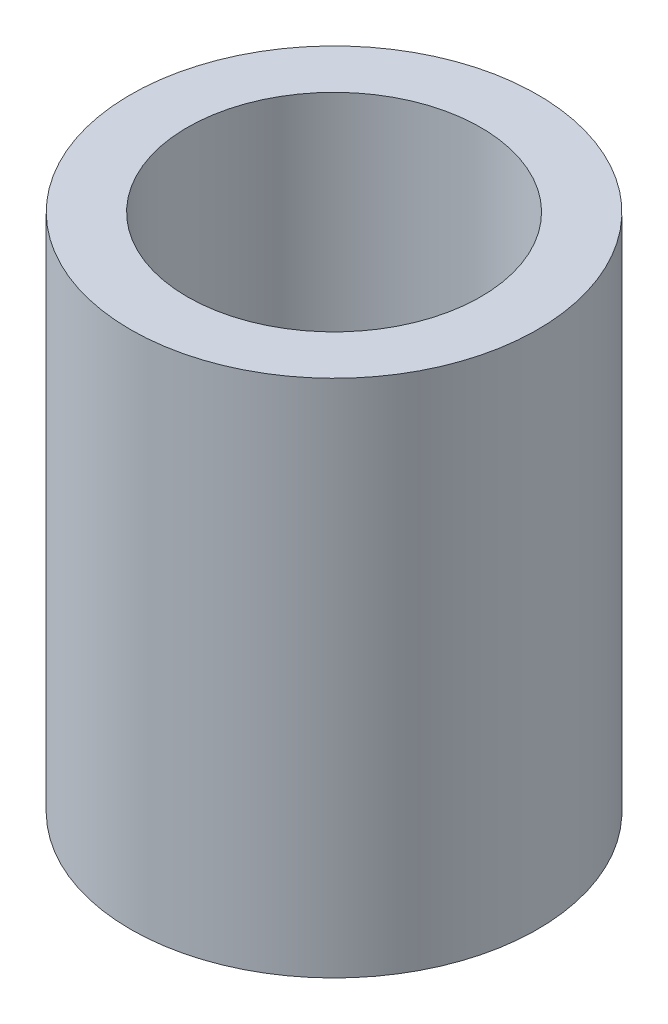
ISO-10303-21;
HEADER;
FILE_DESCRIPTION(('STEP AP214'),'2;1');
FILE_NAME('part.step','',(''),(''),'','','');
FILE_SCHEMA(('AUTOMOTIVE_DESIGN { 1 0 10303 214 1 1 1 1 }'));
ENDSEC;
DATA;
#1=APPLICATION_CONTEXT('core data for automotive mechanical design processes');
#2=APPLICATION_PROTOCOL_DEFINITION('international standard','automotive_design',2000,#1);
#3=PRODUCT_CONTEXT('',#1,'mechanical');
#4=PRODUCT('Part','Part','',(#3));
#5=PRODUCT_RELATED_PRODUCT_CATEGORY('part','',(#4));
#6=PRODUCT_DEFINITION_FORMATION('','',#4);
#7=PRODUCT_DEFINITION_CONTEXT('part definition',#1,'design');
#8=PRODUCT_DEFINITION('design','',#6,#7);
#9=PRODUCT_DEFINITION_SHAPE('','',#8);
#10=(LENGTH_UNIT() NAMED_UNIT(*) SI_UNIT(.MILLI.,.METRE.));
#11=(NAMED_UNIT(*) PLANE_ANGLE_UNIT() SI_UNIT($,.RADIAN.));
#12=(NAMED_UNIT(*) SI_UNIT($,.STERADIAN.) SOLID_ANGLE_UNIT());
#13=UNCERTAINTY_MEASURE_WITH_UNIT(LENGTH_MEASURE(1.E-05),#10,'distance_accuracy_value','');
#14=(GEOMETRIC_REPRESENTATION_CONTEXT(3) GLOBAL_UNCERTAINTY_ASSIGNED_CONTEXT((#13)) GLOBAL_UNIT_ASSIGNED_CONTEXT((#10,
#11,#12)) REPRESENTATION_CONTEXT('',''));
#15=CARTESIAN_POINT('',(0.,0.,0.));
#16=DIRECTION('',(0.,0.,1.));
#17=DIRECTION('',(1.,0.,0.));
#18=AXIS2_PLACEMENT_3D('',#15,#16,#17);
#19=CARTESIAN_POINT('',(0.,51.0343994985615,0.));
#20=DIRECTION('',(0.,-1.,0.));
#21=DIRECTION('',(0.,0.,-1.));
#22=AXIS2_PLACEMENT_3D('',#19,#20,#21);
#23=CYLINDRICAL_SURFACE('',#22,20.);
#24=CARTESIAN_POINT('',(0.,51.0343994985615,0.));
#25=DIRECTION('',(0.,1.,0.));
#26=DIRECTION('',(0.,0.,1.));
#27=AXIS2_PLACEMENT_3D('',#24,#25,#26);
#28=CIRCLE('',#27,20.);
#29=CARTESIAN_POINT('',(0.,51.0343994985615,20.));
#30=VERTEX_POINT('',#29);
#31=EDGE_CURVE('E10',#30,#30,#28,.T.);
#32=ORIENTED_EDGE('',*,*,#31,.F.);
#33=EDGE_LOOP('',(#32));
#34=FACE_BOUND('',#33,.T.);
#35=CARTESIAN_POINT('',(0.,0.,0.));
#36=DIRECTION('',(0.,1.,0.));
#37=DIRECTION('',(0.,0.,1.));
#38=AXIS2_PLACEMENT_3D('',#35,#36,#37);
#39=CIRCLE('',#38,20.);
#40=CARTESIAN_POINT('',(0.,0.,20.));
#41=VERTEX_POINT('',#40);
#42=EDGE_CURVE('E37',#41,#41,#39,.T.);
#43=ORIENTED_EDGE('',*,*,#42,.T.);
#44=EDGE_LOOP('',(#43));
#45=FACE_BOUND('',#44,.T.);
#46=ADVANCED_FACE('F40',(#34,#45),#23,.T.);
#47=CARTESIAN_POINT('',(0.,51.0343994985615,0.));
#48=DIRECTION('',(0.,1.,0.));
#49=DIRECTION('',(0.,0.,1.));
#50=AXIS2_PLACEMENT_3D('',#47,#48,#49);
#51=PLANE('',#50);
#52=CARTESIAN_POINT('',(0.,51.0343994985615,0.));
#53=DIRECTION('',(0.,1.,0.));
#54=DIRECTION('',(0.,0.,1.));
#55=AXIS2_PLACEMENT_3D('',#52,#53,#54);
#56=CIRCLE('',#55,14.4187017479739);
#57=CARTESIAN_POINT('',(0.,51.0343994985615,14.4187017479739));
#58=VERTEX_POINT('',#57);
#59=EDGE_CURVE('E50',#58,#58,#56,.T.);
#60=ORIENTED_EDGE('',*,*,#59,.F.);
#61=EDGE_LOOP('',(#60));
#62=FACE_BOUND('',#61,.T.);
#63=ORIENTED_EDGE('',*,*,#31,.T.);
#64=EDGE_LOOP('',(#63));
#65=FACE_BOUND('',#64,.T.);
#66=ADVANCED_FACE('F59',(#62,#65),#51,.T.);
#67=CARTESIAN_POINT('',(0.,0.,0.));
#68=DIRECTION('',(0.,1.,0.));
#69=DIRECTION('',(0.,0.,1.));
#70=AXIS2_PLACEMENT_3D('',#67,#68,#69);
#71=PLANE('',#70);
#72=CARTESIAN_POINT('',(0.,0.,0.));
#73=DIRECTION('',(0.,1.,0.));
#74=DIRECTION('',(0.,0.,1.));
#75=AXIS2_PLACEMENT_3D('',#72,#73,#74);
#76=CIRCLE('',#75,14.4187017479739);
#77=CARTESIAN_POINT('',(0.,0.,14.4187017479739));
#78=VERTEX_POINT('',#77);
#79=EDGE_CURVE('E47',#78,#78,#76,.T.);
#80=ORIENTED_EDGE('',*,*,#79,.T.);
#81=EDGE_LOOP('',(#80));
#82=FACE_BOUND('',#81,.T.);
#83=ORIENTED_EDGE('',*,*,#42,.F.);
#84=EDGE_LOOP('',(#83));
#85=FACE_BOUND('',#84,.T.);
#86=ADVANCED_FACE('F58',(#82,#85),#71,.F.);
#87=CARTESIAN_POINT('',(0.,51.0343994985615,0.));
#88=DIRECTION('',(0.,-1.,0.));
#89=DIRECTION('',(0.,0.,-1.));
#90=AXIS2_PLACEMENT_3D('',#87,#88,#89);
#91=CYLINDRICAL_SURFACE('',#90,14.4187017479739);
#92=ORIENTED_EDGE('',*,*,#59,.T.);
#93=EDGE_LOOP('',(#92));
#94=FACE_BOUND('',#93,.T.);
#95=ORIENTED_EDGE('',*,*,#79,.F.);
#96=EDGE_LOOP('',(#95));
#97=FACE_BOUND('',#96,.T.);
#98=ADVANCED_FACE('F54',(#94,#97),#91,.F.);
#99=CLOSED_SHELL('',(#46,#66,#86,#98));
#100=MANIFOLD_SOLID_BREP('B2',#99);
#101=ADVANCED_BREP_SHAPE_REPRESENTATION('',(#18,#100),#14);
#102=SHAPE_DEFINITION_REPRESENTATION(#9,#101);
ENDSEC;
END-ISO-10303-21;
